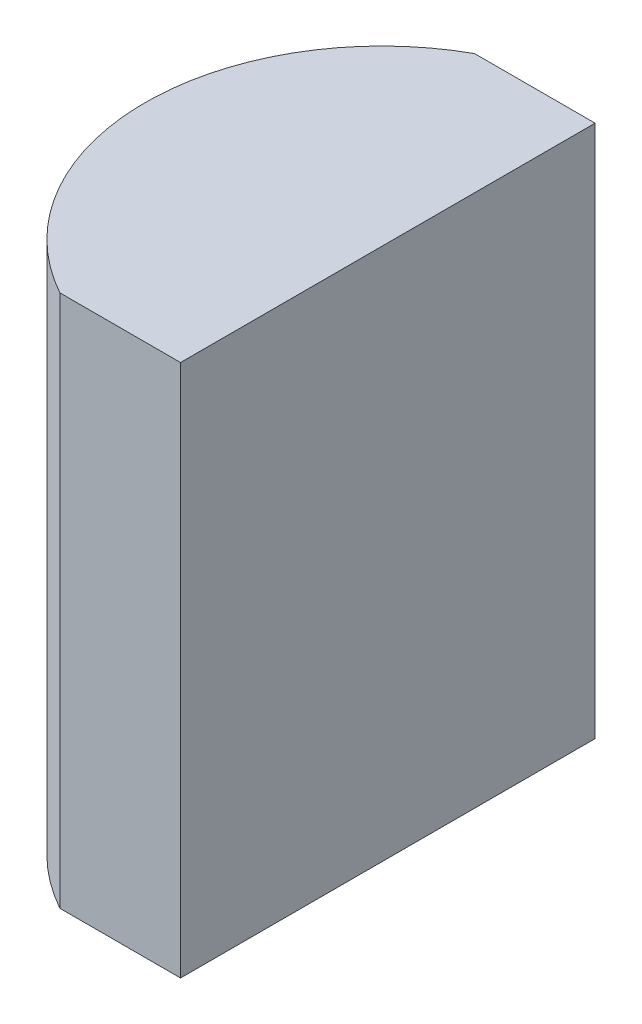
ISO-10303-21;
HEADER;
FILE_DESCRIPTION(('STEP AP214'),'2;1');
FILE_NAME('part.step','',(''),(''),'','','');
FILE_SCHEMA(('AUTOMOTIVE_DESIGN { 1 0 10303 214 1 1 1 1 }'));
ENDSEC;
DATA;
#1=APPLICATION_CONTEXT('core data for automotive mechanical design processes');
#2=APPLICATION_PROTOCOL_DEFINITION('international standard','automotive_design',2000,#1);
#3=PRODUCT_CONTEXT('',#1,'mechanical');
#4=PRODUCT('Part','Part','',(#3));
#5=PRODUCT_RELATED_PRODUCT_CATEGORY('part','',(#4));
#6=PRODUCT_DEFINITION_FORMATION('','',#4);
#7=PRODUCT_DEFINITION_CONTEXT('part definition',#1,'design');
#8=PRODUCT_DEFINITION('design','',#6,#7);
#9=PRODUCT_DEFINITION_SHAPE('','',#8);
#10=(LENGTH_UNIT() NAMED_UNIT(*) SI_UNIT(.MILLI.,.METRE.));
#11=(NAMED_UNIT(*) PLANE_ANGLE_UNIT() SI_UNIT($,.RADIAN.));
#12=(NAMED_UNIT(*) SI_UNIT($,.STERADIAN.) SOLID_ANGLE_UNIT());
#13=UNCERTAINTY_MEASURE_WITH_UNIT(LENGTH_MEASURE(1.E-05),#10,'distance_accuracy_value','');
#14=(GEOMETRIC_REPRESENTATION_CONTEXT(3) GLOBAL_UNCERTAINTY_ASSIGNED_CONTEXT((#13)) GLOBAL_UNIT_ASSIGNED_CONTEXT((#10,
#11,#12)) REPRESENTATION_CONTEXT('',''));
#15=CARTESIAN_POINT('',(0.,0.,0.));
#16=DIRECTION('',(0.,0.,1.));
#17=DIRECTION('',(1.,0.,0.));
#18=AXIS2_PLACEMENT_3D('',#15,#16,#17);
#19=CARTESIAN_POINT('',(4.35520433485127,9.,0.));
#20=DIRECTION('',(0.,-1.,0.));
#21=DIRECTION('',(0.,0.,-1.));
#22=AXIS2_PLACEMENT_3D('',#19,#20,#21);
#23=CYLINDRICAL_SURFACE('',#22,4.);
#24=CARTESIAN_POINT('',(4.35520433485127,0.,0.));
#25=DIRECTION('',(0.,1.,0.));
#26=DIRECTION('',(0.,0.,1.));
#27=AXIS2_PLACEMENT_3D('',#24,#25,#26);
#28=CIRCLE('',#27,4.);
#29=CARTESIAN_POINT('',(2.41871266174756,0.,-3.5));
#30=VERTEX_POINT('',#29);
#31=CARTESIAN_POINT('',(2.41871266174756,0.,3.5));
#32=VERTEX_POINT('',#31);
#33=EDGE_CURVE('E100',#30,#32,#28,.T.);
#34=ORIENTED_EDGE('',*,*,#33,.T.);
#35=DIRECTION('',(0.,-1.,0.));
#36=VECTOR('',#35,1.);
#37=CARTESIAN_POINT('',(2.41871266174756,9.,3.5));
#38=LINE('',#37,#36);
#39=CARTESIAN_POINT('',(2.41871266174756,9.,3.5));
#40=VERTEX_POINT('',#39);
#41=EDGE_CURVE('E11',#40,#32,#38,.T.);
#42=ORIENTED_EDGE('',*,*,#41,.F.);
#43=CARTESIAN_POINT('',(4.35520433485127,9.,0.));
#44=DIRECTION('',(0.,1.,0.));
#45=DIRECTION('',(0.,0.,1.));
#46=AXIS2_PLACEMENT_3D('',#43,#44,#45);
#47=CIRCLE('',#46,4.);
#48=CARTESIAN_POINT('',(2.41871266174756,9.,-3.5));
#49=VERTEX_POINT('',#48);
#50=EDGE_CURVE('E88',#49,#40,#47,.T.);
#51=ORIENTED_EDGE('',*,*,#50,.F.);
#52=DIRECTION('',(0.,-1.,0.));
#53=VECTOR('',#52,1.);
#54=CARTESIAN_POINT('',(2.41871266174756,9.,-3.5));
#55=LINE('',#54,#53);
#56=EDGE_CURVE('E96',#49,#30,#55,.T.);
#57=ORIENTED_EDGE('',*,*,#56,.T.);
#58=EDGE_LOOP('',(#34,#42,#51,#57));
#59=FACE_BOUND('',#58,.T.);
#60=ADVANCED_FACE('F37',(#59),#23,.T.);
#61=CARTESIAN_POINT('',(2.41871266174756,9.,3.5));
#62=DIRECTION('',(0.,0.,-1.));
#63=DIRECTION('',(-1.,0.,0.));
#64=AXIS2_PLACEMENT_3D('',#61,#62,#63);
#65=PLANE('',#64);
#66=DIRECTION('',(1.,0.,0.));
#67=VECTOR('',#66,1.);
#68=CARTESIAN_POINT('',(2.41871266174756,0.,3.5));
#69=LINE('',#68,#67);
#70=CARTESIAN_POINT('',(4.45520433485127,0.,3.5));
#71=VERTEX_POINT('',#70);
#72=EDGE_CURVE('E92',#32,#71,#69,.T.);
#73=ORIENTED_EDGE('',*,*,#72,.T.);
#74=DIRECTION('',(0.,-1.,0.));
#75=VECTOR('',#74,1.);
#76=CARTESIAN_POINT('',(4.45520433485127,9.,3.5));
#77=LINE('',#76,#75);
#78=CARTESIAN_POINT('',(4.45520433485127,9.,3.5));
#79=VERTEX_POINT('',#78);
#80=EDGE_CURVE('E45',#79,#71,#77,.T.);
#81=ORIENTED_EDGE('',*,*,#80,.F.);
#82=DIRECTION('',(1.,0.,0.));
#83=VECTOR('',#82,1.);
#84=CARTESIAN_POINT('',(2.41871266174756,9.,3.5));
#85=LINE('',#84,#83);
#86=EDGE_CURVE('E83',#40,#79,#85,.T.);
#87=ORIENTED_EDGE('',*,*,#86,.F.);
#88=ORIENTED_EDGE('',*,*,#41,.T.);
#89=EDGE_LOOP('',(#73,#81,#87,#88));
#90=FACE_BOUND('',#89,.T.);
#91=ADVANCED_FACE('F91',(#90),#65,.F.);
#92=CARTESIAN_POINT('',(4.45520433485127,9.,-3.5));
#93=DIRECTION('',(-1.,0.,0.));
#94=DIRECTION('',(0.,0.,1.));
#95=AXIS2_PLACEMENT_3D('',#92,#93,#94);
#96=PLANE('',#95);
#97=DIRECTION('',(0.,0.,-1.));
#98=VECTOR('',#97,1.);
#99=CARTESIAN_POINT('',(4.45520433485127,0.,-3.5));
#100=LINE('',#99,#98);
#101=CARTESIAN_POINT('',(4.45520433485127,0.,-3.5));
#102=VERTEX_POINT('',#101);
#103=EDGE_CURVE('E70',#71,#102,#100,.T.);
#104=ORIENTED_EDGE('',*,*,#103,.T.);
#105=DIRECTION('',(0.,-1.,0.));
#106=VECTOR('',#105,1.);
#107=CARTESIAN_POINT('',(4.45520433485127,9.,-3.5));
#108=LINE('',#107,#106);
#109=CARTESIAN_POINT('',(4.45520433485127,9.,-3.5));
#110=VERTEX_POINT('',#109);
#111=EDGE_CURVE('E93',#110,#102,#108,.T.);
#112=ORIENTED_EDGE('',*,*,#111,.F.);
#113=DIRECTION('',(0.,0.,-1.));
#114=VECTOR('',#113,1.);
#115=CARTESIAN_POINT('',(4.45520433485127,9.,-3.5));
#116=LINE('',#115,#114);
#117=EDGE_CURVE('E86',#79,#110,#116,.T.);
#118=ORIENTED_EDGE('',*,*,#117,.F.);
#119=ORIENTED_EDGE('',*,*,#80,.T.);
#120=EDGE_LOOP('',(#104,#112,#118,#119));
#121=FACE_BOUND('',#120,.T.);
#122=ADVANCED_FACE('F94',(#121),#96,.F.);
#123=CARTESIAN_POINT('',(2.41871266174756,9.,-3.5));
#124=DIRECTION('',(0.,0.,1.));
#125=DIRECTION('',(1.,0.,0.));
#126=AXIS2_PLACEMENT_3D('',#123,#124,#125);
#127=PLANE('',#126);
#128=DIRECTION('',(-1.,0.,0.));
#129=VECTOR('',#128,1.);
#130=CARTESIAN_POINT('',(2.41871266174756,0.,-3.5));
#131=LINE('',#130,#129);
#132=EDGE_CURVE('E76',#102,#30,#131,.T.);
#133=ORIENTED_EDGE('',*,*,#132,.T.);
#134=ORIENTED_EDGE('',*,*,#56,.F.);
#135=DIRECTION('',(-1.,0.,0.));
#136=VECTOR('',#135,1.);
#137=CARTESIAN_POINT('',(2.41871266174756,9.,-3.5));
#138=LINE('',#137,#136);
#139=EDGE_CURVE('E53',#110,#49,#138,.T.);
#140=ORIENTED_EDGE('',*,*,#139,.F.);
#141=ORIENTED_EDGE('',*,*,#111,.T.);
#142=EDGE_LOOP('',(#133,#134,#140,#141));
#143=FACE_BOUND('',#142,.T.);
#144=ADVANCED_FACE('F107',(#143),#127,.F.);
#145=CARTESIAN_POINT('',(4.35520433485127,9.,0.));
#146=DIRECTION('',(0.,1.,0.));
#147=DIRECTION('',(0.,0.,1.));
#148=AXIS2_PLACEMENT_3D('',#145,#146,#147);
#149=PLANE('',#148);
#150=ORIENTED_EDGE('',*,*,#50,.T.);
#151=ORIENTED_EDGE('',*,*,#86,.T.);
#152=ORIENTED_EDGE('',*,*,#117,.T.);
#153=ORIENTED_EDGE('',*,*,#139,.T.);
#154=EDGE_LOOP('',(#150,#151,#152,#153));
#155=FACE_BOUND('',#154,.T.);
#156=ADVANCED_FACE('F84',(#155),#149,.T.);
#157=CARTESIAN_POINT('',(4.35520433485127,0.,0.));
#158=DIRECTION('',(0.,1.,0.));
#159=DIRECTION('',(0.,0.,1.));
#160=AXIS2_PLACEMENT_3D('',#157,#158,#159);
#161=PLANE('',#160);
#162=ORIENTED_EDGE('',*,*,#33,.F.);
#163=ORIENTED_EDGE('',*,*,#132,.F.);
#164=ORIENTED_EDGE('',*,*,#103,.F.);
#165=ORIENTED_EDGE('',*,*,#72,.F.);
#166=EDGE_LOOP('',(#162,#163,#164,#165));
#167=FACE_BOUND('',#166,.T.);
#168=ADVANCED_FACE('F110',(#167),#161,.F.);
#169=CLOSED_SHELL('',(#60,#91,#122,#144,#156,#168));
#170=MANIFOLD_SOLID_BREP('B2',#169);
#171=ADVANCED_BREP_SHAPE_REPRESENTATION('',(#18,#170),#14);
#172=SHAPE_DEFINITION_REPRESENTATION(#9,#171);
ENDSEC;
END-ISO-10303-21;
